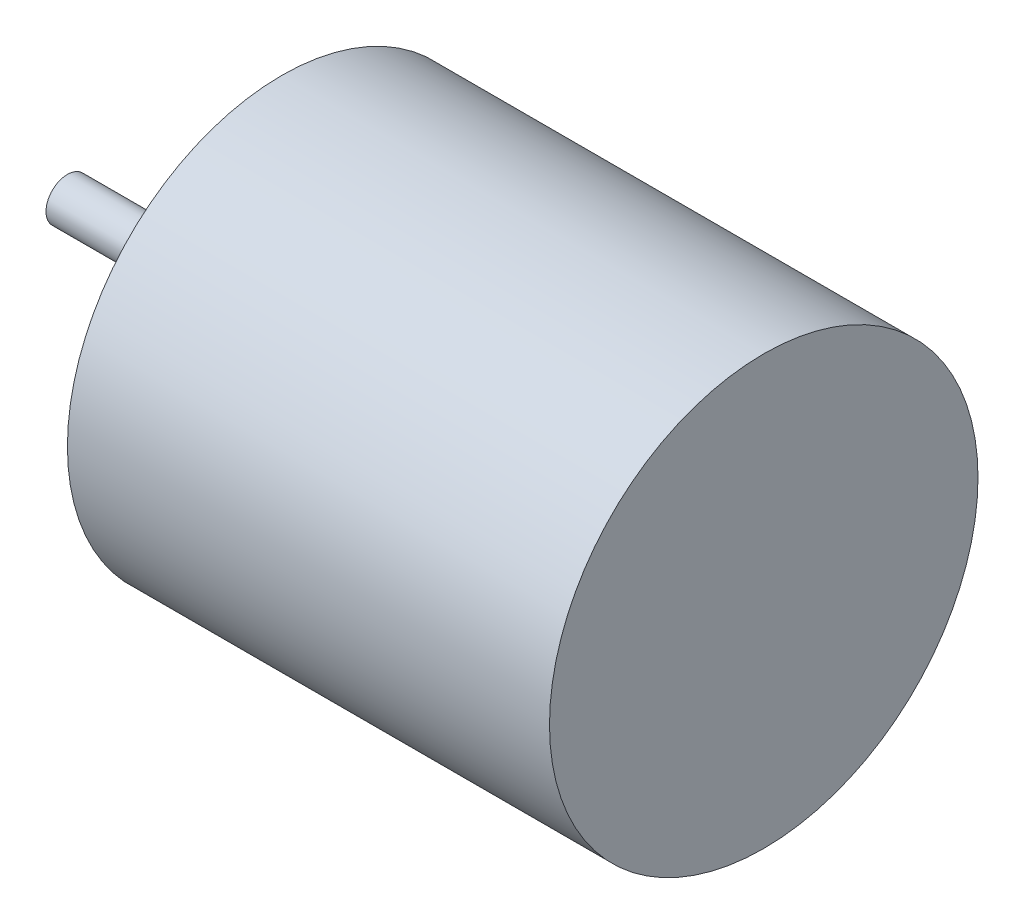
ISO-10303-21;
HEADER;
FILE_DESCRIPTION(('STEP AP214'),'2;1');
FILE_NAME('part.step','',(''),(''),'','','');
FILE_SCHEMA(('AUTOMOTIVE_DESIGN { 1 0 10303 214 1 1 1 1 }'));
ENDSEC;
DATA;
#1=APPLICATION_CONTEXT('core data for automotive mechanical design processes');
#2=APPLICATION_PROTOCOL_DEFINITION('international standard','automotive_design',2000,#1);
#3=PRODUCT_CONTEXT('',#1,'mechanical');
#4=PRODUCT('Part','Part','',(#3));
#5=PRODUCT_RELATED_PRODUCT_CATEGORY('part','',(#4));
#6=PRODUCT_DEFINITION_FORMATION('','',#4);
#7=PRODUCT_DEFINITION_CONTEXT('part definition',#1,'design');
#8=PRODUCT_DEFINITION('design','',#6,#7);
#9=PRODUCT_DEFINITION_SHAPE('','',#8);
#10=(LENGTH_UNIT() NAMED_UNIT(*) SI_UNIT(.MILLI.,.METRE.));
#11=(NAMED_UNIT(*) PLANE_ANGLE_UNIT() SI_UNIT($,.RADIAN.));
#12=(NAMED_UNIT(*) SI_UNIT($,.STERADIAN.) SOLID_ANGLE_UNIT());
#13=UNCERTAINTY_MEASURE_WITH_UNIT(LENGTH_MEASURE(1.E-05),#10,'distance_accuracy_value','');
#14=(GEOMETRIC_REPRESENTATION_CONTEXT(3) GLOBAL_UNCERTAINTY_ASSIGNED_CONTEXT((#13)) GLOBAL_UNIT_ASSIGNED_CONTEXT((#10,
#11,#12)) REPRESENTATION_CONTEXT('',''));
#15=CARTESIAN_POINT('',(0.,0.,0.));
#16=DIRECTION('',(0.,0.,1.));
#17=DIRECTION('',(1.,0.,0.));
#18=AXIS2_PLACEMENT_3D('',#15,#16,#17);
#19=CARTESIAN_POINT('',(9.,0.,0.));
#20=DIRECTION('',(1.,0.,0.));
#21=DIRECTION('',(0.,1.,0.));
#22=AXIS2_PLACEMENT_3D('',#19,#20,#21);
#23=CYLINDRICAL_SURFACE('',#22,0.399999999999999);
#24=CARTESIAN_POINT('',(0.,0.,0.));
#25=DIRECTION('',(1.,0.,0.));
#26=DIRECTION('',(0.,1.,0.));
#27=AXIS2_PLACEMENT_3D('',#24,#25,#26);
#28=CIRCLE('',#27,0.399999999999999);
#29=CARTESIAN_POINT('',(0.,0.399999999999999,0.));
#30=VERTEX_POINT('',#29);
#31=EDGE_CURVE('E48',#30,#30,#28,.T.);
#32=ORIENTED_EDGE('',*,*,#31,.F.);
#33=EDGE_LOOP('',(#32));
#34=FACE_BOUND('',#33,.T.);
#35=CARTESIAN_POINT('',(-4.,0.,0.));
#36=DIRECTION('',(1.,0.,0.));
#37=DIRECTION('',(0.,1.,0.));
#38=AXIS2_PLACEMENT_3D('',#35,#36,#37);
#39=CIRCLE('',#38,0.399999999999999);
#40=CARTESIAN_POINT('',(-4.,0.399999999999999,0.));
#41=VERTEX_POINT('',#40);
#42=EDGE_CURVE('E10',#41,#41,#39,.T.);
#43=ORIENTED_EDGE('',*,*,#42,.T.);
#44=EDGE_LOOP('',(#43));
#45=FACE_BOUND('',#44,.T.);
#46=ADVANCED_FACE('F34',(#34,#45),#23,.T.);
#47=CARTESIAN_POINT('',(-4.,0.,0.));
#48=DIRECTION('',(1.,0.,0.));
#49=DIRECTION('',(0.,1.,0.));
#50=AXIS2_PLACEMENT_3D('',#47,#48,#49);
#51=PLANE('',#50);
#52=ORIENTED_EDGE('',*,*,#42,.F.);
#53=EDGE_LOOP('',(#52));
#54=FACE_BOUND('',#53,.T.);
#55=ADVANCED_FACE('F57',(#54),#51,.F.);
#56=CARTESIAN_POINT('',(9.,0.,0.));
#57=DIRECTION('',(-1.,0.,0.));
#58=DIRECTION('',(0.,-1.,0.));
#59=AXIS2_PLACEMENT_3D('',#56,#57,#58);
#60=PLANE('',#59);
#61=CARTESIAN_POINT('',(9.,0.,0.));
#62=DIRECTION('',(1.,0.,0.));
#63=DIRECTION('',(0.,1.,0.));
#64=AXIS2_PLACEMENT_3D('',#61,#62,#63);
#65=CIRCLE('',#64,4.);
#66=CARTESIAN_POINT('',(9.,4.,0.));
#67=VERTEX_POINT('',#66);
#68=EDGE_CURVE('E40',#67,#67,#65,.T.);
#69=ORIENTED_EDGE('',*,*,#68,.T.);
#70=EDGE_LOOP('',(#69));
#71=FACE_BOUND('',#70,.T.);
#72=ADVANCED_FACE('F61',(#71),#60,.F.);
#73=CARTESIAN_POINT('',(9.,0.,0.));
#74=DIRECTION('',(1.,0.,0.));
#75=DIRECTION('',(0.,1.,0.));
#76=AXIS2_PLACEMENT_3D('',#73,#74,#75);
#77=CYLINDRICAL_SURFACE('',#76,4.);
#78=ORIENTED_EDGE('',*,*,#68,.F.);
#79=EDGE_LOOP('',(#78));
#80=FACE_BOUND('',#79,.T.);
#81=CARTESIAN_POINT('',(0.,0.,0.));
#82=DIRECTION('',(1.,0.,0.));
#83=DIRECTION('',(0.,1.,0.));
#84=AXIS2_PLACEMENT_3D('',#81,#82,#83);
#85=CIRCLE('',#84,4.);
#86=CARTESIAN_POINT('',(0.,4.,0.));
#87=VERTEX_POINT('',#86);
#88=EDGE_CURVE('E44',#87,#87,#85,.T.);
#89=ORIENTED_EDGE('',*,*,#88,.T.);
#90=EDGE_LOOP('',(#89));
#91=FACE_BOUND('',#90,.T.);
#92=ADVANCED_FACE('F66',(#80,#91),#77,.T.);
#93=CARTESIAN_POINT('',(0.,0.,0.));
#94=DIRECTION('',(1.,0.,0.));
#95=DIRECTION('',(0.,1.,0.));
#96=AXIS2_PLACEMENT_3D('',#93,#94,#95);
#97=PLANE('',#96);
#98=ORIENTED_EDGE('',*,*,#88,.F.);
#99=EDGE_LOOP('',(#98));
#100=FACE_BOUND('',#99,.T.);
#101=ORIENTED_EDGE('',*,*,#31,.T.);
#102=EDGE_LOOP('',(#101));
#103=FACE_BOUND('',#102,.T.);
#104=ADVANCED_FACE('F54',(#100,#103),#97,.F.);
#105=CLOSED_SHELL('',(#46,#55,#72,#92,#104));
#106=MANIFOLD_SOLID_BREP('B2',#105);
#107=ADVANCED_BREP_SHAPE_REPRESENTATION('',(#18,#106),#14);
#108=SHAPE_DEFINITION_REPRESENTATION(#9,#107);
ENDSEC;
END-ISO-10303-21;
